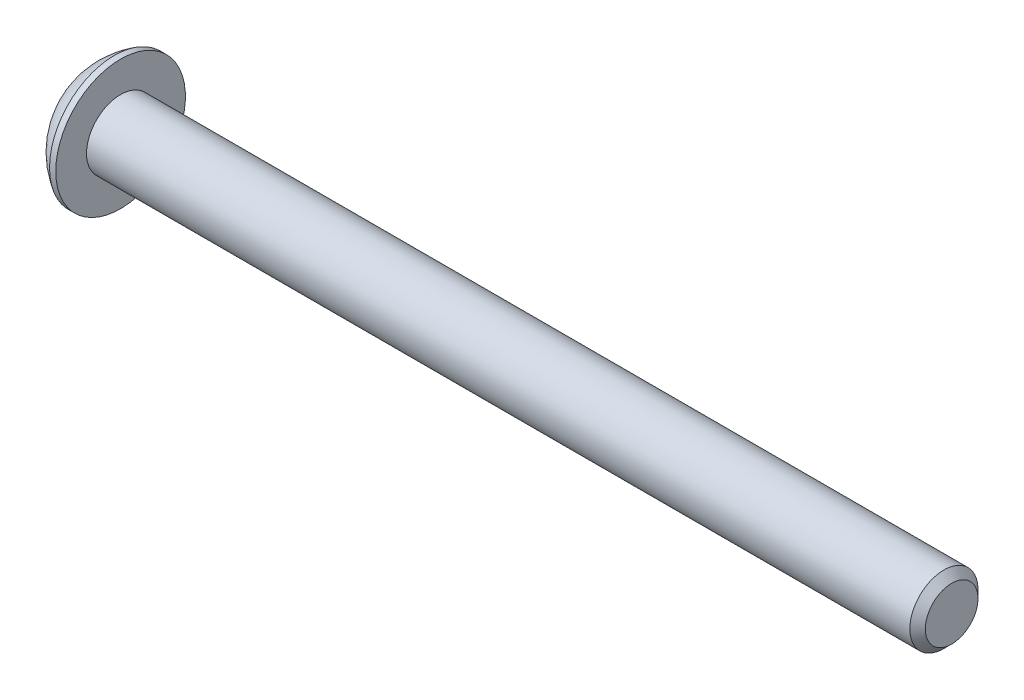
ISO-10303-21;
HEADER;
FILE_DESCRIPTION(('STEP AP214'),'2;1');
FILE_NAME('part.step','',(''),(''),'','','');
FILE_SCHEMA(('AUTOMOTIVE_DESIGN { 1 0 10303 214 1 1 1 1 }'));
ENDSEC;
DATA;
#1=APPLICATION_CONTEXT('core data for automotive mechanical design processes');
#2=APPLICATION_PROTOCOL_DEFINITION('international standard','automotive_design',2000,#1);
#3=PRODUCT_CONTEXT('',#1,'mechanical');
#4=PRODUCT('Part','Part','',(#3));
#5=PRODUCT_RELATED_PRODUCT_CATEGORY('part','',(#4));
#6=PRODUCT_DEFINITION_FORMATION('','',#4);
#7=PRODUCT_DEFINITION_CONTEXT('part definition',#1,'design');
#8=PRODUCT_DEFINITION('design','',#6,#7);
#9=PRODUCT_DEFINITION_SHAPE('','',#8);
#10=(LENGTH_UNIT() NAMED_UNIT(*) SI_UNIT(.MILLI.,.METRE.));
#11=(NAMED_UNIT(*) PLANE_ANGLE_UNIT() SI_UNIT($,.RADIAN.));
#12=(NAMED_UNIT(*) SI_UNIT($,.STERADIAN.) SOLID_ANGLE_UNIT());
#13=UNCERTAINTY_MEASURE_WITH_UNIT(LENGTH_MEASURE(1.E-05),#10,'distance_accuracy_value','');
#14=(GEOMETRIC_REPRESENTATION_CONTEXT(3) GLOBAL_UNCERTAINTY_ASSIGNED_CONTEXT((#13)) GLOBAL_UNIT_ASSIGNED_CONTEXT((#10,
#11,#12)) REPRESENTATION_CONTEXT('',''));
#15=CARTESIAN_POINT('',(0.,0.,0.));
#16=DIRECTION('',(0.,0.,1.));
#17=DIRECTION('',(1.,0.,0.));
#18=AXIS2_PLACEMENT_3D('',#15,#16,#17);
#19=CARTESIAN_POINT('',(1.32080000000034,0.,0.));
#20=DIRECTION('',(-1.,0.,0.));
#21=DIRECTION('',(0.,0.,1.));
#22=AXIS2_PLACEMENT_3D('',#19,#20,#21);
#23=CONICAL_SURFACE('',#22,1.1937999999998,1.04719755119608);
#24=CARTESIAN_POINT('',(2.01004075135902,0.,4.44089209850063E-13));
#25=VERTEX_POINT('',#24);
#26=VERTEX_LOOP('',#25);
#27=FACE_BOUND('',#26,.T.);
#28=CARTESIAN_POINT('',(1.32080000000009,0.,0.));
#29=DIRECTION('',(-1.,0.,0.));
#30=DIRECTION('',(0.,0.,1.));
#31=AXIS2_PLACEMENT_3D('',#28,#29,#30);
#32=CIRCLE('',#31,1.19380000000024);
#33=CARTESIAN_POINT('',(1.32080000000004,-1.03386112703797,0.59690000000006));
#34=VERTEX_POINT('',#33);
#35=CARTESIAN_POINT('',(1.32080000000004,0.,1.19380000000012));
#36=VERTEX_POINT('',#35);
#37=EDGE_CURVE('E20',#34,#36,#32,.T.);
#38=ORIENTED_EDGE('',*,*,#37,.T.);
#39=CARTESIAN_POINT('',(1.32080000000009,0.,0.));
#40=DIRECTION('',(-1.,0.,0.));
#41=DIRECTION('',(0.,0.,1.));
#42=AXIS2_PLACEMENT_3D('',#39,#40,#41);
#43=CIRCLE('',#42,1.19380000000024);
#44=CARTESIAN_POINT('',(1.32080000000004,1.03386112703797,0.596900000000061));
#45=VERTEX_POINT('',#44);
#46=EDGE_CURVE('E148',#36,#45,#43,.T.);
#47=ORIENTED_EDGE('',*,*,#46,.T.);
#48=CARTESIAN_POINT('',(1.32080000000009,0.,0.));
#49=DIRECTION('',(-1.,0.,0.));
#50=DIRECTION('',(0.,0.,1.));
#51=AXIS2_PLACEMENT_3D('',#48,#49,#50);
#52=CIRCLE('',#51,1.19380000000024);
#53=CARTESIAN_POINT('',(1.32080000000004,1.03386112703797,-0.596900000000061));
#54=VERTEX_POINT('',#53);
#55=EDGE_CURVE('E318',#45,#54,#52,.T.);
#56=ORIENTED_EDGE('',*,*,#55,.T.);
#57=CARTESIAN_POINT('',(1.32080000000009,0.,0.));
#58=DIRECTION('',(-1.,0.,0.));
#59=DIRECTION('',(0.,0.,1.));
#60=AXIS2_PLACEMENT_3D('',#57,#58,#59);
#61=CIRCLE('',#60,1.19380000000024);
#62=CARTESIAN_POINT('',(1.32080000000004,1.49457637585666E-12,-1.19380000000012));
#63=VERTEX_POINT('',#62);
#64=EDGE_CURVE('E319',#54,#63,#61,.T.);
#65=ORIENTED_EDGE('',*,*,#64,.T.);
#66=CARTESIAN_POINT('',(1.32080000000009,0.,0.));
#67=DIRECTION('',(-1.,0.,0.));
#68=DIRECTION('',(0.,0.,1.));
#69=AXIS2_PLACEMENT_3D('',#66,#67,#68);
#70=CIRCLE('',#69,1.19380000000024);
#71=CARTESIAN_POINT('',(1.32080000000004,-1.03386112703797,-0.59690000000006));
#72=VERTEX_POINT('',#71);
#73=EDGE_CURVE('E93',#63,#72,#70,.T.);
#74=ORIENTED_EDGE('',*,*,#73,.T.);
#75=CARTESIAN_POINT('',(1.32080000000009,0.,0.));
#76=DIRECTION('',(-1.,0.,0.));
#77=DIRECTION('',(0.,0.,1.));
#78=AXIS2_PLACEMENT_3D('',#75,#76,#77);
#79=CIRCLE('',#78,1.19380000000024);
#80=EDGE_CURVE('E89',#72,#34,#79,.T.);
#81=ORIENTED_EDGE('',*,*,#80,.T.);
#82=EDGE_LOOP('',(#38,#47,#56,#65,#74,#81));
#83=FACE_BOUND('',#82,.T.);
#84=ADVANCED_FACE('F17',(#27,#83),#23,.F.);
#85=CARTESIAN_POINT('',(1.3208,-2.06772225407572,-1.1938));
#86=DIRECTION('',(1.,0.,0.));
#87=DIRECTION('',(0.,0.,-1.));
#88=AXIS2_PLACEMENT_3D('',#85,#86,#87);
#89=PLANE('',#88);
#90=DIRECTION('',(0.,0.5,0.866025403784439));
#91=VECTOR('',#90,1.);
#92=CARTESIAN_POINT('',(1.3208,-1.37848150271715,0.));
#93=LINE('',#92,#91);
#94=CARTESIAN_POINT('',(1.3208,-0.689240751358574,1.1938));
#95=VERTEX_POINT('',#94);
#96=EDGE_CURVE('E101',#95,#34,#93,.F.);
#97=ORIENTED_EDGE('',*,*,#96,.F.);
#98=DIRECTION('',(0.,1.,0.));
#99=VECTOR('',#98,1.);
#100=CARTESIAN_POINT('',(1.3208,-0.689240751358574,1.1938));
#101=LINE('',#100,#99);
#102=EDGE_CURVE('E103',#36,#95,#101,.F.);
#103=ORIENTED_EDGE('',*,*,#102,.F.);
#104=ORIENTED_EDGE('',*,*,#37,.F.);
#105=EDGE_LOOP('',(#97,#103,#104));
#106=FACE_BOUND('',#105,.T.);
#107=ADVANCED_FACE('F99',(#106),#89,.F.);
#108=CARTESIAN_POINT('',(1.3208,-2.06772225407572,-1.1938));
#109=DIRECTION('',(1.,0.,0.));
#110=DIRECTION('',(0.,0.,-1.));
#111=AXIS2_PLACEMENT_3D('',#108,#109,#110);
#112=PLANE('',#111);
#113=DIRECTION('',(0.,-0.5,0.866025403784439));
#114=VECTOR('',#113,1.);
#115=CARTESIAN_POINT('',(1.3208,-0.689240751358574,-1.1938));
#116=LINE('',#115,#114);
#117=CARTESIAN_POINT('',(1.3208,-1.37848150271715,0.));
#118=VERTEX_POINT('',#117);
#119=EDGE_CURVE('E109',#118,#72,#116,.F.);
#120=ORIENTED_EDGE('',*,*,#119,.F.);
#121=DIRECTION('',(0.,0.5,0.866025403784439));
#122=VECTOR('',#121,1.);
#123=CARTESIAN_POINT('',(1.3208,-1.37848150271715,0.));
#124=LINE('',#123,#122);
#125=EDGE_CURVE('E106',#34,#118,#124,.F.);
#126=ORIENTED_EDGE('',*,*,#125,.F.);
#127=ORIENTED_EDGE('',*,*,#80,.F.);
#128=EDGE_LOOP('',(#120,#126,#127));
#129=FACE_BOUND('',#128,.T.);
#130=ADVANCED_FACE('F107',(#129),#112,.F.);
#131=CARTESIAN_POINT('',(1.3208,-2.06772225407572,-1.1938));
#132=DIRECTION('',(1.,0.,0.));
#133=DIRECTION('',(0.,0.,-1.));
#134=AXIS2_PLACEMENT_3D('',#131,#132,#133);
#135=PLANE('',#134);
#136=DIRECTION('',(0.,1.,0.));
#137=VECTOR('',#136,1.);
#138=CARTESIAN_POINT('',(1.3208,0.689240751358577,-1.1938));
#139=LINE('',#138,#137);
#140=CARTESIAN_POINT('',(1.3208,-0.689240751358574,-1.1938));
#141=VERTEX_POINT('',#140);
#142=EDGE_CURVE('E288',#141,#63,#139,.T.);
#143=ORIENTED_EDGE('',*,*,#142,.F.);
#144=DIRECTION('',(0.,-0.5,0.866025403784439));
#145=VECTOR('',#144,1.);
#146=CARTESIAN_POINT('',(1.3208,-0.689240751358574,-1.1938));
#147=LINE('',#146,#145);
#148=EDGE_CURVE('E300',#72,#141,#147,.F.);
#149=ORIENTED_EDGE('',*,*,#148,.F.);
#150=ORIENTED_EDGE('',*,*,#73,.F.);
#151=EDGE_LOOP('',(#143,#149,#150));
#152=FACE_BOUND('',#151,.T.);
#153=ADVANCED_FACE('F191',(#152),#135,.F.);
#154=CARTESIAN_POINT('',(1.3208,-2.06772225407572,-1.1938));
#155=DIRECTION('',(1.,0.,0.));
#156=DIRECTION('',(0.,0.,-1.));
#157=AXIS2_PLACEMENT_3D('',#154,#155,#156);
#158=PLANE('',#157);
#159=DIRECTION('',(0.,-0.5,-0.866025403784439));
#160=VECTOR('',#159,1.);
#161=CARTESIAN_POINT('',(1.3208,1.37848150271715,0.));
#162=LINE('',#161,#160);
#163=CARTESIAN_POINT('',(1.3208,0.689240751358577,-1.1938));
#164=VERTEX_POINT('',#163);
#165=EDGE_CURVE('E274',#164,#54,#162,.F.);
#166=ORIENTED_EDGE('',*,*,#165,.F.);
#167=DIRECTION('',(0.,1.,0.));
#168=VECTOR('',#167,1.);
#169=CARTESIAN_POINT('',(1.3208,0.689240751358577,-1.1938));
#170=LINE('',#169,#168);
#171=EDGE_CURVE('E285',#63,#164,#170,.T.);
#172=ORIENTED_EDGE('',*,*,#171,.F.);
#173=ORIENTED_EDGE('',*,*,#64,.F.);
#174=EDGE_LOOP('',(#166,#172,#173));
#175=FACE_BOUND('',#174,.T.);
#176=ADVANCED_FACE('F187',(#175),#158,.F.);
#177=CARTESIAN_POINT('',(1.3208,-2.06772225407572,-1.1938));
#178=DIRECTION('',(1.,0.,0.));
#179=DIRECTION('',(0.,0.,-1.));
#180=AXIS2_PLACEMENT_3D('',#177,#178,#179);
#181=PLANE('',#180);
#182=DIRECTION('',(0.,0.5,-0.866025403784439));
#183=VECTOR('',#182,1.);
#184=CARTESIAN_POINT('',(1.3208,0.689240751358576,1.1938));
#185=LINE('',#184,#183);
#186=CARTESIAN_POINT('',(1.3208,1.37848150271715,0.));
#187=VERTEX_POINT('',#186);
#188=EDGE_CURVE('E253',#187,#45,#185,.F.);
#189=ORIENTED_EDGE('',*,*,#188,.F.);
#190=DIRECTION('',(0.,-0.5,-0.866025403784439));
#191=VECTOR('',#190,1.);
#192=CARTESIAN_POINT('',(1.3208,1.37848150271715,0.));
#193=LINE('',#192,#191);
#194=EDGE_CURVE('E272',#54,#187,#193,.F.);
#195=ORIENTED_EDGE('',*,*,#194,.F.);
#196=ORIENTED_EDGE('',*,*,#55,.F.);
#197=EDGE_LOOP('',(#189,#195,#196));
#198=FACE_BOUND('',#197,.T.);
#199=ADVANCED_FACE('F183',(#198),#181,.F.);
#200=CARTESIAN_POINT('',(1.3208,-2.06772225407572,-1.1938));
#201=DIRECTION('',(1.,0.,0.));
#202=DIRECTION('',(0.,0.,-1.));
#203=AXIS2_PLACEMENT_3D('',#200,#201,#202);
#204=PLANE('',#203);
#205=DIRECTION('',(0.,1.,0.));
#206=VECTOR('',#205,1.);
#207=CARTESIAN_POINT('',(1.3208,-0.689240751358574,1.1938));
#208=LINE('',#207,#206);
#209=CARTESIAN_POINT('',(1.3208,0.689240751358576,1.1938));
#210=VERTEX_POINT('',#209);
#211=EDGE_CURVE('E118',#210,#36,#208,.F.);
#212=ORIENTED_EDGE('',*,*,#211,.F.);
#213=DIRECTION('',(0.,0.5,-0.866025403784439));
#214=VECTOR('',#213,1.);
#215=CARTESIAN_POINT('',(1.3208,0.689240751358576,1.1938));
#216=LINE('',#215,#214);
#217=EDGE_CURVE('E256',#45,#210,#216,.F.);
#218=ORIENTED_EDGE('',*,*,#217,.F.);
#219=ORIENTED_EDGE('',*,*,#46,.F.);
#220=EDGE_LOOP('',(#212,#218,#219));
#221=FACE_BOUND('',#220,.T.);
#222=ADVANCED_FACE('F179',(#221),#204,.F.);
#223=CARTESIAN_POINT('',(1.3208,-0.689240751358574,1.1938));
#224=DIRECTION('',(0.,0.,-1.));
#225=DIRECTION('',(0.,1.,0.));
#226=AXIS2_PLACEMENT_3D('',#223,#224,#225);
#227=PLANE('',#226);
#228=DIRECTION('',(0.,1.,0.));
#229=VECTOR('',#228,1.);
#230=CARTESIAN_POINT('',(0.,0.,1.1938));
#231=LINE('',#230,#229);
#232=CARTESIAN_POINT('',(0.,0.689240751358577,1.1938));
#233=VERTEX_POINT('',#232);
#234=CARTESIAN_POINT('',(0.,-0.689240751358574,1.1938));
#235=VERTEX_POINT('',#234);
#236=EDGE_CURVE('E250',#233,#235,#231,.F.);
#237=ORIENTED_EDGE('',*,*,#236,.F.);
#238=DIRECTION('',(1.,0.,0.));
#239=VECTOR('',#238,1.);
#240=CARTESIAN_POINT('',(1.3208,0.689240751358576,1.1938));
#241=LINE('',#240,#239);
#242=EDGE_CURVE('E262',#210,#233,#241,.F.);
#243=ORIENTED_EDGE('',*,*,#242,.F.);
#244=ORIENTED_EDGE('',*,*,#211,.T.);
#245=ORIENTED_EDGE('',*,*,#102,.T.);
#246=DIRECTION('',(1.,0.,0.));
#247=VECTOR('',#246,1.);
#248=CARTESIAN_POINT('',(1.3208,-0.689240751358574,1.1938));
#249=LINE('',#248,#247);
#250=EDGE_CURVE('E112',#235,#95,#249,.T.);
#251=ORIENTED_EDGE('',*,*,#250,.F.);
#252=EDGE_LOOP('',(#237,#243,#244,#245,#251));
#253=FACE_BOUND('',#252,.T.);
#254=ADVANCED_FACE('F176',(#253),#227,.T.);
#255=CARTESIAN_POINT('',(1.3208,-1.37848150271715,0.));
#256=DIRECTION('',(0.,0.866025403784439,-0.5));
#257=DIRECTION('',(0.,0.5,0.866025403784439));
#258=AXIS2_PLACEMENT_3D('',#255,#256,#257);
#259=PLANE('',#258);
#260=DIRECTION('',(0.,-0.5,-0.866025403784439));
#261=VECTOR('',#260,1.);
#262=CARTESIAN_POINT('',(0.,-0.689240751358574,1.1938));
#263=LINE('',#262,#261);
#264=CARTESIAN_POINT('',(0.,-1.37848150271715,0.));
#265=VERTEX_POINT('',#264);
#266=EDGE_CURVE('E247',#235,#265,#263,.T.);
#267=ORIENTED_EDGE('',*,*,#266,.F.);
#268=ORIENTED_EDGE('',*,*,#250,.T.);
#269=ORIENTED_EDGE('',*,*,#96,.T.);
#270=ORIENTED_EDGE('',*,*,#125,.T.);
#271=DIRECTION('',(1.,0.,0.));
#272=VECTOR('',#271,1.);
#273=CARTESIAN_POINT('',(1.3208,-1.37848150271715,0.));
#274=LINE('',#273,#272);
#275=EDGE_CURVE('E297',#265,#118,#274,.T.);
#276=ORIENTED_EDGE('',*,*,#275,.F.);
#277=EDGE_LOOP('',(#267,#268,#269,#270,#276));
#278=FACE_BOUND('',#277,.T.);
#279=ADVANCED_FACE('F116',(#278),#259,.T.);
#280=CARTESIAN_POINT('',(1.3208,-0.689240751358574,-1.1938));
#281=DIRECTION('',(0.,0.866025403784439,0.5));
#282=DIRECTION('',(0.,-0.5,0.866025403784439));
#283=AXIS2_PLACEMENT_3D('',#280,#281,#282);
#284=PLANE('',#283);
#285=DIRECTION('',(0.,0.5,-0.866025403784439));
#286=VECTOR('',#285,1.);
#287=CARTESIAN_POINT('',(0.,-1.37848150271715,0.));
#288=LINE('',#287,#286);
#289=CARTESIAN_POINT('',(0.,-0.689240751358574,-1.1938));
#290=VERTEX_POINT('',#289);
#291=EDGE_CURVE('E244',#265,#290,#288,.T.);
#292=ORIENTED_EDGE('',*,*,#291,.F.);
#293=ORIENTED_EDGE('',*,*,#275,.T.);
#294=ORIENTED_EDGE('',*,*,#119,.T.);
#295=ORIENTED_EDGE('',*,*,#148,.T.);
#296=DIRECTION('',(1.,0.,0.));
#297=VECTOR('',#296,1.);
#298=CARTESIAN_POINT('',(1.3208,-0.689240751358574,-1.1938));
#299=LINE('',#298,#297);
#300=EDGE_CURVE('E282',#290,#141,#299,.T.);
#301=ORIENTED_EDGE('',*,*,#300,.F.);
#302=EDGE_LOOP('',(#292,#293,#294,#295,#301));
#303=FACE_BOUND('',#302,.T.);
#304=ADVANCED_FACE('F169',(#303),#284,.T.);
#305=CARTESIAN_POINT('',(1.3208,0.689240751358577,-1.1938));
#306=DIRECTION('',(0.,0.,1.));
#307=DIRECTION('',(1.,0.,0.));
#308=AXIS2_PLACEMENT_3D('',#305,#306,#307);
#309=PLANE('',#308);
#310=DIRECTION('',(0.,1.,0.));
#311=VECTOR('',#310,1.);
#312=CARTESIAN_POINT('',(0.,0.,-1.1938));
#313=LINE('',#312,#311);
#314=CARTESIAN_POINT('',(0.,0.689240751358577,-1.1938));
#315=VERTEX_POINT('',#314);
#316=EDGE_CURVE('E241',#290,#315,#313,.T.);
#317=ORIENTED_EDGE('',*,*,#316,.F.);
#318=ORIENTED_EDGE('',*,*,#300,.T.);
#319=ORIENTED_EDGE('',*,*,#142,.T.);
#320=ORIENTED_EDGE('',*,*,#171,.T.);
#321=DIRECTION('',(1.,0.,0.));
#322=VECTOR('',#321,1.);
#323=CARTESIAN_POINT('',(1.3208,0.689240751358577,-1.1938));
#324=LINE('',#323,#322);
#325=EDGE_CURVE('E257',#315,#164,#324,.T.);
#326=ORIENTED_EDGE('',*,*,#325,.F.);
#327=EDGE_LOOP('',(#317,#318,#319,#320,#326));
#328=FACE_BOUND('',#327,.T.);
#329=ADVANCED_FACE('F166',(#328),#309,.T.);
#330=CARTESIAN_POINT('',(1.3208,1.37848150271715,0.));
#331=DIRECTION('',(0.,-0.866025403784439,0.5));
#332=DIRECTION('',(0.,-0.5,-0.866025403784439));
#333=AXIS2_PLACEMENT_3D('',#330,#331,#332);
#334=PLANE('',#333);
#335=DIRECTION('',(0.,0.5,0.866025403784439));
#336=VECTOR('',#335,1.);
#337=CARTESIAN_POINT('',(0.,0.689240751358577,-1.1938));
#338=LINE('',#337,#336);
#339=CARTESIAN_POINT('',(0.,1.37848150271715,0.));
#340=VERTEX_POINT('',#339);
#341=EDGE_CURVE('E238',#315,#340,#338,.T.);
#342=ORIENTED_EDGE('',*,*,#341,.F.);
#343=ORIENTED_EDGE('',*,*,#325,.T.);
#344=ORIENTED_EDGE('',*,*,#165,.T.);
#345=ORIENTED_EDGE('',*,*,#194,.T.);
#346=DIRECTION('',(1.,0.,0.));
#347=VECTOR('',#346,1.);
#348=CARTESIAN_POINT('',(1.3208,1.37848150271715,0.));
#349=LINE('',#348,#347);
#350=EDGE_CURVE('E35',#340,#187,#349,.T.);
#351=ORIENTED_EDGE('',*,*,#350,.F.);
#352=EDGE_LOOP('',(#342,#343,#344,#345,#351));
#353=FACE_BOUND('',#352,.T.);
#354=ADVANCED_FACE('F162',(#353),#334,.T.);
#355=CARTESIAN_POINT('',(1.3208,0.689240751358576,1.1938));
#356=DIRECTION('',(0.,-0.866025403784439,-0.5));
#357=DIRECTION('',(0.,0.5,-0.866025403784439));
#358=AXIS2_PLACEMENT_3D('',#355,#356,#357);
#359=PLANE('',#358);
#360=DIRECTION('',(0.,-0.5,0.866025403784439));
#361=VECTOR('',#360,1.);
#362=CARTESIAN_POINT('',(0.,1.37848150271715,0.));
#363=LINE('',#362,#361);
#364=EDGE_CURVE('E147',#340,#233,#363,.T.);
#365=ORIENTED_EDGE('',*,*,#364,.F.);
#366=ORIENTED_EDGE('',*,*,#350,.T.);
#367=ORIENTED_EDGE('',*,*,#188,.T.);
#368=ORIENTED_EDGE('',*,*,#217,.T.);
#369=ORIENTED_EDGE('',*,*,#242,.T.);
#370=EDGE_LOOP('',(#365,#366,#367,#368,#369));
#371=FACE_BOUND('',#370,.T.);
#372=ADVANCED_FACE('F158',(#371),#359,.T.);
#373=CARTESIAN_POINT('',(0.,0.,0.));
#374=DIRECTION('',(-1.,0.,0.));
#375=DIRECTION('',(0.,0.,1.));
#376=AXIS2_PLACEMENT_3D('',#373,#374,#375);
#377=PLANE('',#376);
#378=ORIENTED_EDGE('',*,*,#341,.T.);
#379=ORIENTED_EDGE('',*,*,#364,.T.);
#380=ORIENTED_EDGE('',*,*,#236,.T.);
#381=ORIENTED_EDGE('',*,*,#266,.T.);
#382=ORIENTED_EDGE('',*,*,#291,.T.);
#383=ORIENTED_EDGE('',*,*,#316,.T.);
#384=EDGE_LOOP('',(#378,#379,#380,#381,#382,#383));
#385=FACE_BOUND('',#384,.T.);
#386=CARTESIAN_POINT('',(0.,1.9812,0.));
#387=CARTESIAN_POINT('',(0.,1.9811996664299,0.0556258831179428));
#388=CARTESIAN_POINT('',(0.,1.97885520380442,0.111261989398606));
#389=CARTESIAN_POINT('',(0.,1.96949260169541,0.222149719830458));
#390=CARTESIAN_POINT('',(0.,1.96247308239605,0.277401225602895));
#391=CARTESIAN_POINT('',(0.,1.94379192841038,0.387209508139747));
#392=CARTESIAN_POINT('',(-1.85325793235264E-13,1.93212292489526,0.441765039546365));
#393=CARTESIAN_POINT('',(1.86344214223505E-13,1.90422331175315,0.549729449347493));
#394=CARTESIAN_POINT('',(6.94543371897454E-13,1.88798900035338,0.603137359208869));
#395=CARTESIAN_POINT('',(1.15501975216981E-12,1.83266214476501,0.760839131321828));
#396=CARTESIAN_POINT('',(0.,1.78690023648845,0.862876433575429));
#397=CARTESIAN_POINT('',(0.,1.67887358150667,1.05780719540872));
#398=CARTESIAN_POINT('',(9.54193214892627E-13,1.6166082074585,1.15070030720801));
#399=CARTESIAN_POINT('',(5.94805591894675E-13,1.51224157140982,1.28116890915697));
#400=CARTESIAN_POINT('',(1.63221293851378E-13,1.4755970394354,1.32320451127026));
#401=CARTESIAN_POINT('',(-1.62196980336157E-13,1.39893832619713,1.40400288695709));
#402=CARTESIAN_POINT('',(0.,1.35892742784698,1.44276877695455));
#403=CARTESIAN_POINT('',(1.14362537325405E-13,1.23416504602197,1.55382272417904));
#404=CARTESIAN_POINT('',(0.,1.14466125559859,1.62089527952111));
#405=CARTESIAN_POINT('',(0.,0.955712144178167,1.7390221808118));
#406=CARTESIAN_POINT('',(0.,0.856267198233564,1.79007713076007));
#407=CARTESIAN_POINT('',(0.,0.650206345910843,1.87477637530954));
#408=CARTESIAN_POINT('',(0.,0.543590516134855,1.90842085586267));
#409=CARTESIAN_POINT('',(0.,0.326226155292018,1.95733039300656));
#410=CARTESIAN_POINT('',(0.,0.21547760215793,1.97259535144288));
#411=CARTESIAN_POINT('',(0.,-0.00701040587544639,1.98431697865418));
#412=CARTESIAN_POINT('',(0.,-0.118749860774734,1.98077364742917));
#413=CARTESIAN_POINT('',(0.,-0.340050178355485,1.95497485623825));
#414=CARTESIAN_POINT('',(0.,-0.449611052668255,1.93271949620218));
#415=CARTESIAN_POINT('',(0.,-0.663431110729174,1.87014138774523));
#416=CARTESIAN_POINT('',(0.,-0.76769023783852,1.82981844635272));
#417=CARTESIAN_POINT('',(0.,-0.968005760719347,1.73219968377096));
#418=CARTESIAN_POINT('',(0.,-1.0640618469811,1.6749032225164));
#419=CARTESIAN_POINT('',(0.,-1.19980276751283,1.57757371205873));
#420=CARTESIAN_POINT('',(0.,-1.24366557129213,1.54322665019466));
#421=CARTESIAN_POINT('',(0.,-1.32838995706696,1.47093063174264));
#422=CARTESIAN_POINT('',(0.,-1.36924860178706,1.43297823102439));
#423=CARTESIAN_POINT('',(0.,-1.48674671849223,1.31419842051173));
#424=CARTESIAN_POINT('',(0.,-1.55842832343237,1.22836221289311));
#425=CARTESIAN_POINT('',(0.,-1.6863396856475,1.04586168272493));
#426=CARTESIAN_POINT('',(0.,-1.7425700302488,0.949197771949774));
#427=CARTESIAN_POINT('',(0.,-1.8141614250401,0.798182600298684));
#428=CARTESIAN_POINT('',(0.,-1.83591780585875,0.746776203847791));
#429=CARTESIAN_POINT('',(0.,-1.87500754181092,0.642341081688636));
#430=CARTESIAN_POINT('',(0.,-1.89234447645404,0.589313708122847));
#431=CARTESIAN_POINT('',(0.,-1.92246053433554,0.482076273028395));
#432=CARTESIAN_POINT('',(0.,-1.93524685475118,0.42786822425751));
#433=CARTESIAN_POINT('',(0.,-1.95620937250494,0.318578151844611));
#434=CARTESIAN_POINT('',(0.,-1.96438692958147,0.263496390912872));
#435=CARTESIAN_POINT('',(0.,-1.97388528284653,0.173607715038558));
#436=CARTESIAN_POINT('',(0.,-1.97662743364426,0.138944718024998));
#437=CARTESIAN_POINT('',(0.,-1.98028489645283,0.0695224782567002));
#438=CARTESIAN_POINT('',(0.,-1.98120020846367,0.0347632355019631));
#439=CARTESIAN_POINT('',(0.,-1.9811996664299,-0.0556258831179437));
#440=CARTESIAN_POINT('',(0.,-1.97885520380442,-0.111261989398607));
#441=CARTESIAN_POINT('',(0.,-1.96949260169541,-0.222149719830459));
#442=CARTESIAN_POINT('',(0.,-1.96247308239605,-0.277401225602897));
#443=CARTESIAN_POINT('',(0.,-1.94379192841039,-0.387209508139749));
#444=CARTESIAN_POINT('',(-1.85269749640691E-13,-1.93212292489526,-0.441765039546367));
#445=CARTESIAN_POINT('',(1.86288125054388E-13,-1.90422331175315,-0.549729449347495));
#446=CARTESIAN_POINT('',(6.94525090263764E-13,-1.88798900035338,-0.603137359208872));
#447=CARTESIAN_POINT('',(1.15505622829081E-12,-1.83266214476501,-0.760839131321831));
#448=CARTESIAN_POINT('',(0.,-1.78690023648845,-0.862876433575431));
#449=CARTESIAN_POINT('',(0.,-1.67887358150667,-1.05780719540872));
#450=CARTESIAN_POINT('',(9.54248812869379E-13,-1.6166082074585,-1.15070030720801));
#451=CARTESIAN_POINT('',(5.94777756479239E-13,-1.51224157140982,-1.28116890915698));
#452=CARTESIAN_POINT('',(1.63138949183833E-13,-1.47559703943539,-1.32320451127027));
#453=CARTESIAN_POINT('',(-1.62114715061273E-13,-1.39893832619713,-1.40400288695709));
#454=CARTESIAN_POINT('',(0.,-1.35892742784699,-1.44276877695455));
#455=CARTESIAN_POINT('',(1.13760489124207E-13,-1.23416504602197,-1.55382272417904));
#456=CARTESIAN_POINT('',(0.,-1.14466125559859,-1.62089527952111));
#457=CARTESIAN_POINT('',(0.,-0.95571214417816,-1.73902218081179));
#458=CARTESIAN_POINT('',(0.,-0.856267198233559,-1.79007713076007));
#459=CARTESIAN_POINT('',(0.,-0.650206345910841,-1.87477637530954));
#460=CARTESIAN_POINT('',(0.,-0.543590516134854,-1.90842085586267));
#461=CARTESIAN_POINT('',(0.,-0.326226155292018,-1.95733039300657));
#462=CARTESIAN_POINT('',(0.,-0.215477602157929,-1.97259535144288));
#463=CARTESIAN_POINT('',(0.,0.0070104058754487,-1.98431697865418));
#464=CARTESIAN_POINT('',(0.,0.118749860774737,-1.98077364742916));
#465=CARTESIAN_POINT('',(0.,0.340050178355489,-1.95497485623824));
#466=CARTESIAN_POINT('',(0.,0.44961105266826,-1.93271949620218));
#467=CARTESIAN_POINT('',(0.,0.663431110729178,-1.87014138774524));
#468=CARTESIAN_POINT('',(0.,0.767690237838524,-1.82981844635272));
#469=CARTESIAN_POINT('',(0.,0.968005760719348,-1.73219968377096));
#470=CARTESIAN_POINT('',(0.,1.0640618469811,-1.67490322251639));
#471=CARTESIAN_POINT('',(0.,1.19980276751283,-1.57757371205873));
#472=CARTESIAN_POINT('',(0.,1.24366557129214,-1.54322665019465));
#473=CARTESIAN_POINT('',(0.,1.32838995706696,-1.47093063174263));
#474=CARTESIAN_POINT('',(0.,1.36924860178706,-1.43297823102439));
#475=CARTESIAN_POINT('',(0.,1.48674671849223,-1.31419842051172));
#476=CARTESIAN_POINT('',(0.,1.55842832343237,-1.22836221289311));
#477=CARTESIAN_POINT('',(0.,1.6863396856475,-1.04586168272492));
#478=CARTESIAN_POINT('',(0.,1.7425700302488,-0.949197771949768));
#479=CARTESIAN_POINT('',(0.,1.8141614250401,-0.798182600298677));
#480=CARTESIAN_POINT('',(0.,1.83591780585875,-0.746776203847785));
#481=CARTESIAN_POINT('',(0.,1.87500754181092,-0.64234108168863));
#482=CARTESIAN_POINT('',(0.,1.89234447645404,-0.589313708122841));
#483=CARTESIAN_POINT('',(0.,1.92246053433555,-0.482076273028389));
#484=CARTESIAN_POINT('',(0.,1.93524685475118,-0.427868224257505));
#485=CARTESIAN_POINT('',(0.,1.95620937250494,-0.318578151844605));
#486=CARTESIAN_POINT('',(0.,1.96438692958147,-0.263496390912866));
#487=CARTESIAN_POINT('',(0.,1.97388528284653,-0.173607715038553));
#488=CARTESIAN_POINT('',(0.,1.97662743364426,-0.138944718024994));
#489=CARTESIAN_POINT('',(0.,1.98028489645283,-0.0695224782566989));
#490=CARTESIAN_POINT('',(0.,1.98120020846367,-0.034763235501963));
#491=CARTESIAN_POINT('',(0.,1.9812,0.));
#492=B_SPLINE_CURVE_WITH_KNOTS('',3,(#386,#387,#388,#389,#390,#391,#392,#393,#394,#395,#396,
#397,#398,#399,#400,#401,#402,#403,#404,#405,#406,#407,#408,#409,#410,#411,#412,#413,#414,#415,
#416,#417,#418,#419,#420,#421,#422,#423,#424,#425,#426,#427,#428,#429,#430,#431,#432,#433,#434,
#435,#436,#437,#438,#439,#440,#441,#442,#443,#444,#445,#446,#447,#448,#449,#450,#451,#452,#453,
#454,#455,#456,#457,#458,#459,#460,#461,#462,#463,#464,#465,#466,#467,#468,#469,#470,#471,#472,
#473,#474,#475,#476,#477,#478,#479,#480,#481,#482,#483,#484,#485,#486,#487,#488,#489,#490,#491),
.UNSPECIFIED.,.T.,.F.,(4,2,2,2,2,2,2,2,2,2,2,2,2,2,2,2,2,2,2,2,2,2,2,2,2,2,2,2,2,2,2,2,2,2,2,2,
2,2,2,2,2,2,2,2,2,2,2,2,2,2,2,2,4),(0.,0.166845646007828,0.333740557374255,0.500901034367693,
0.668197445942386,1.00199278686282,1.33580081809885,1.50292354032982,1.6698851310853,
2.00370118900129,2.33750465770544,2.67130456115909,3.005106247238,3.33890793331696,
3.67270783677065,4.00651130547476,4.34032736339026,4.50728895414554,4.67441167637632,
5.00821970761259,5.34201504853332,5.50931146010827,5.67647193710191,5.84336684846844,
6.0102124944764,6.11448220058334,6.21875190669029,6.38559755269812,6.55249246406454,
6.71965294105798,6.88694935263268,7.22074469355311,7.55455272478915,7.72167544702011,
7.88863703777559,8.22245309569158,8.55625656439573,8.89005646784938,9.2238581539283,
9.55765984000725,9.89145974346094,10.2252632121651,10.5590792700806,10.7260408608358,
10.8931635830666,11.2269716143029,11.5607669552236,11.7280633667986,11.8952238437922,
12.0621187551587,12.2289644011667,12.3332341072736,12.4375038133806),.UNSPECIFIED.);
#493=CARTESIAN_POINT('',(0.,1.9812,0.));
#494=VERTEX_POINT('',#493);
#495=EDGE_CURVE('E140',#494,#494,#492,.T.);
#496=ORIENTED_EDGE('',*,*,#495,.F.);
#497=EDGE_LOOP('',(#496));
#498=FACE_BOUND('',#497,.T.);
#499=ADVANCED_FACE('F154',(#385,#498),#377,.T.);
#500=CARTESIAN_POINT('',(4.13385,0.,0.));
#501=DIRECTION('',(0.,1.,0.));
#502=DIRECTION('',(1.,0.,0.));
#503=AXIS2_PLACEMENT_3D('',#500,#501,#502);
#504=SPHERICAL_SURFACE('',#503,4.58408870578439);
#505=CARTESIAN_POINT('',(1.8288,0.,0.));
#506=DIRECTION('',(-1.,0.,0.));
#507=DIRECTION('',(0.,0.,1.));
#508=AXIS2_PLACEMENT_3D('',#505,#506,#507);
#509=CIRCLE('',#508,3.9624);
#510=CARTESIAN_POINT('',(1.8288,0.,3.9624));
#511=VERTEX_POINT('',#510);
#512=EDGE_CURVE('E137',#511,#511,#509,.F.);
#513=ORIENTED_EDGE('',*,*,#512,.F.);
#514=EDGE_LOOP('',(#513));
#515=FACE_BOUND('',#514,.T.);
#516=ORIENTED_EDGE('',*,*,#495,.T.);
#517=EDGE_LOOP('',(#516));
#518=FACE_BOUND('',#517,.T.);
#519=ADVANCED_FACE('F150',(#515,#518),#504,.T.);
#520=CARTESIAN_POINT('',(53.0098,0.,0.));
#521=DIRECTION('',(-1.,0.,0.));
#522=DIRECTION('',(0.,0.,1.));
#523=AXIS2_PLACEMENT_3D('',#520,#521,#522);
#524=PLANE('',#523);
#525=CARTESIAN_POINT('',(53.0097999999839,0.,0.));
#526=DIRECTION('',(-1.,0.,0.));
#527=DIRECTION('',(0.,0.,1.));
#528=AXIS2_PLACEMENT_3D('',#525,#526,#527);
#529=CIRCLE('',#528,1.61036000002923);
#530=CARTESIAN_POINT('',(53.0097999999839,0.,1.61036000002923));
#531=VERTEX_POINT('',#530);
#532=EDGE_CURVE('E134',#531,#531,#529,.T.);
#533=ORIENTED_EDGE('',*,*,#532,.F.);
#534=EDGE_LOOP('',(#533));
#535=FACE_BOUND('',#534,.T.);
#536=ADVANCED_FACE('F222',(#535),#524,.F.);
#537=CARTESIAN_POINT('',(0.,0.,0.));
#538=DIRECTION('',(-1.,0.,0.));
#539=DIRECTION('',(0.,0.,1.));
#540=AXIS2_PLACEMENT_3D('',#537,#538,#539);
#541=CYLINDRICAL_SURFACE('',#540,3.9624);
#542=ORIENTED_EDGE('',*,*,#512,.T.);
#543=EDGE_LOOP('',(#542));
#544=FACE_BOUND('',#543,.T.);
#545=CARTESIAN_POINT('',(2.2098,0.,0.));
#546=DIRECTION('',(-1.,0.,0.));
#547=DIRECTION('',(0.,0.,1.));
#548=AXIS2_PLACEMENT_3D('',#545,#546,#547);
#549=CIRCLE('',#548,3.9624);
#550=CARTESIAN_POINT('',(2.2098,0.,3.9624));
#551=VERTEX_POINT('',#550);
#552=EDGE_CURVE('E131',#551,#551,#549,.T.);
#553=ORIENTED_EDGE('',*,*,#552,.T.);
#554=EDGE_LOOP('',(#553));
#555=FACE_BOUND('',#554,.T.);
#556=ADVANCED_FACE('F219',(#544,#555),#541,.T.);
#557=CARTESIAN_POINT('',(52.5373600000307,0.,0.));
#558=DIRECTION('',(-1.,0.,0.));
#559=DIRECTION('',(0.,0.,1.));
#560=AXIS2_PLACEMENT_3D('',#557,#558,#559);
#561=CONICAL_SURFACE('',#560,2.08279999992556,0.785398163337289);
#562=ORIENTED_EDGE('',*,*,#532,.T.);
#563=EDGE_LOOP('',(#562));
#564=FACE_BOUND('',#563,.T.);
#565=CARTESIAN_POINT('',(52.53736,0.,0.));
#566=DIRECTION('',(-1.,0.,0.));
#567=DIRECTION('',(0.,0.,1.));
#568=AXIS2_PLACEMENT_3D('',#565,#566,#567);
#569=CIRCLE('',#568,2.0828);
#570=CARTESIAN_POINT('',(52.53736,0.,2.0828));
#571=VERTEX_POINT('',#570);
#572=EDGE_CURVE('E26',#571,#571,#569,.T.);
#573=ORIENTED_EDGE('',*,*,#572,.F.);
#574=EDGE_LOOP('',(#573));
#575=FACE_BOUND('',#574,.T.);
#576=ADVANCED_FACE('F211',(#564,#575),#561,.T.);
#577=CARTESIAN_POINT('',(2.2098,2.0828,0.));
#578=DIRECTION('',(-1.,0.,0.));
#579=DIRECTION('',(0.,0.,1.));
#580=AXIS2_PLACEMENT_3D('',#577,#578,#579);
#581=PLANE('',#580);
#582=CARTESIAN_POINT('',(2.2098,0.,0.));
#583=DIRECTION('',(-1.,0.,0.));
#584=DIRECTION('',(0.,0.,1.));
#585=AXIS2_PLACEMENT_3D('',#582,#583,#584);
#586=CIRCLE('',#585,2.0828);
#587=CARTESIAN_POINT('',(2.2098,0.,2.0828));
#588=VERTEX_POINT('',#587);
#589=EDGE_CURVE('E10',#588,#588,#586,.F.);
#590=ORIENTED_EDGE('',*,*,#589,.F.);
#591=EDGE_LOOP('',(#590));
#592=FACE_BOUND('',#591,.T.);
#593=ORIENTED_EDGE('',*,*,#552,.F.);
#594=EDGE_LOOP('',(#593));
#595=FACE_BOUND('',#594,.T.);
#596=ADVANCED_FACE('F205',(#592,#595),#581,.F.);
#597=CARTESIAN_POINT('',(0.,0.,0.));
#598=DIRECTION('',(-1.,0.,0.));
#599=DIRECTION('',(0.,0.,1.));
#600=AXIS2_PLACEMENT_3D('',#597,#598,#599);
#601=CYLINDRICAL_SURFACE('',#600,2.0828);
#602=ORIENTED_EDGE('',*,*,#572,.T.);
#603=EDGE_LOOP('',(#602));
#604=FACE_BOUND('',#603,.T.);
#605=ORIENTED_EDGE('',*,*,#589,.T.);
#606=EDGE_LOOP('',(#605));
#607=FACE_BOUND('',#606,.T.);
#608=ADVANCED_FACE('F203',(#604,#607),#601,.T.);
#609=CLOSED_SHELL('',(#84,#107,#130,#153,#176,#199,#222,#254,#279,#304,#329,#354,#372,#499,#519,
#536,#556,#576,#596,#608));
#610=MANIFOLD_SOLID_BREP('B1',#609);
#611=ADVANCED_BREP_SHAPE_REPRESENTATION('',(#18,#610),#14);
#612=SHAPE_DEFINITION_REPRESENTATION(#9,#611);
ENDSEC;
END-ISO-10303-21;
